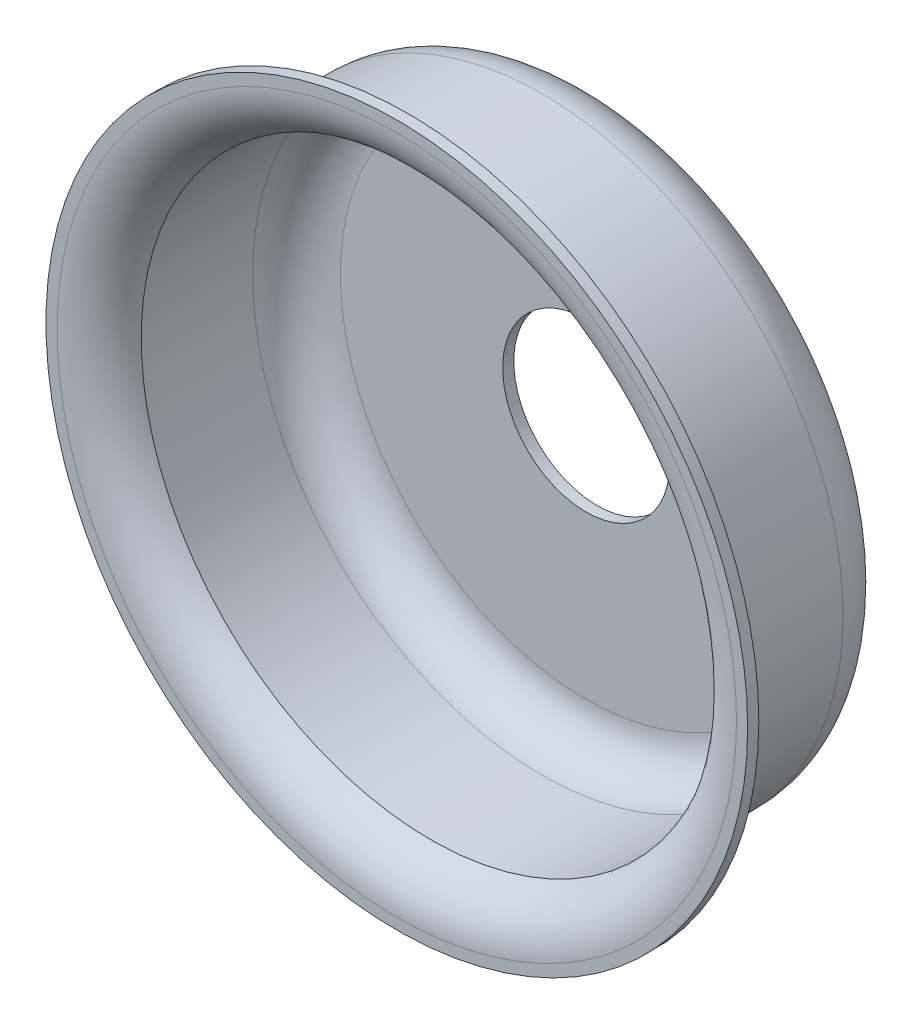
ISO-10303-21;
HEADER;
FILE_DESCRIPTION(('STEP AP214'),'2;1');
FILE_NAME('part.step','',(''),(''),'','','');
FILE_SCHEMA(('AUTOMOTIVE_DESIGN { 1 0 10303 214 1 1 1 1 }'));
ENDSEC;
DATA;
#1=APPLICATION_CONTEXT('core data for automotive mechanical design processes');
#2=APPLICATION_PROTOCOL_DEFINITION('international standard','automotive_design',2000,#1);
#3=PRODUCT_CONTEXT('',#1,'mechanical');
#4=PRODUCT('Part','Part','',(#3));
#5=PRODUCT_RELATED_PRODUCT_CATEGORY('part','',(#4));
#6=PRODUCT_DEFINITION_FORMATION('','',#4);
#7=PRODUCT_DEFINITION_CONTEXT('part definition',#1,'design');
#8=PRODUCT_DEFINITION('design','',#6,#7);
#9=PRODUCT_DEFINITION_SHAPE('','',#8);
#10=(LENGTH_UNIT() NAMED_UNIT(*) SI_UNIT(.MILLI.,.METRE.));
#11=(NAMED_UNIT(*) PLANE_ANGLE_UNIT() SI_UNIT($,.RADIAN.));
#12=(NAMED_UNIT(*) SI_UNIT($,.STERADIAN.) SOLID_ANGLE_UNIT());
#13=UNCERTAINTY_MEASURE_WITH_UNIT(LENGTH_MEASURE(1.E-05),#10,'distance_accuracy_value','');
#14=(GEOMETRIC_REPRESENTATION_CONTEXT(3) GLOBAL_UNCERTAINTY_ASSIGNED_CONTEXT((#13)) GLOBAL_UNIT_ASSIGNED_CONTEXT((#10,
#11,#12)) REPRESENTATION_CONTEXT('',''));
#15=CARTESIAN_POINT('',(0.,0.,0.));
#16=DIRECTION('',(0.,0.,1.));
#17=DIRECTION('',(1.,0.,0.));
#18=AXIS2_PLACEMENT_3D('',#15,#16,#17);
#19=CARTESIAN_POINT('',(0.,0.,11.4444043278498));
#20=DIRECTION('',(0.,0.,1.));
#21=DIRECTION('',(1.,0.,0.));
#22=AXIS2_PLACEMENT_3D('',#19,#20,#21);
#23=CYLINDRICAL_SURFACE('',#22,8.001);
#24=CARTESIAN_POINT('',(0.,0.,0.));
#25=DIRECTION('',(0.,0.,1.));
#26=DIRECTION('',(1.,0.,0.));
#27=AXIS2_PLACEMENT_3D('',#24,#25,#26);
#28=CIRCLE('',#27,8.001);
#29=CARTESIAN_POINT('',(8.001,0.,0.));
#30=VERTEX_POINT('',#29);
#31=EDGE_CURVE('E12',#30,#30,#28,.T.);
#32=ORIENTED_EDGE('',*,*,#31,.F.);
#33=EDGE_LOOP('',(#32));
#34=FACE_BOUND('',#33,.T.);
#35=CARTESIAN_POINT('',(0.,0.,-0.254000000000001));
#36=DIRECTION('',(0.,0.,1.));
#37=DIRECTION('',(1.,0.,0.));
#38=AXIS2_PLACEMENT_3D('',#35,#36,#37);
#39=CIRCLE('',#38,8.001);
#40=CARTESIAN_POINT('',(8.001,0.,-0.254000000000001));
#41=VERTEX_POINT('',#40);
#42=EDGE_CURVE('E86',#41,#41,#39,.T.);
#43=ORIENTED_EDGE('',*,*,#42,.T.);
#44=EDGE_LOOP('',(#43));
#45=FACE_BOUND('',#44,.T.);
#46=ADVANCED_FACE('F46',(#34,#45),#23,.T.);
#47=CARTESIAN_POINT('',(0.,8.001,0.));
#48=DIRECTION('',(0.,0.,-1.));
#49=DIRECTION('',(-1.,0.,0.));
#50=AXIS2_PLACEMENT_3D('',#47,#48,#49);
#51=PLANE('',#50);
#52=CARTESIAN_POINT('',(0.,0.,0.));
#53=DIRECTION('',(0.,0.,1.));
#54=DIRECTION('',(1.,0.,0.));
#55=AXIS2_PLACEMENT_3D('',#52,#53,#54);
#56=CIRCLE('',#55,7.747);
#57=CARTESIAN_POINT('',(7.747,0.,0.));
#58=VERTEX_POINT('',#57);
#59=EDGE_CURVE('E52',#58,#58,#56,.T.);
#60=ORIENTED_EDGE('',*,*,#59,.F.);
#61=EDGE_LOOP('',(#60));
#62=FACE_BOUND('',#61,.T.);
#63=ORIENTED_EDGE('',*,*,#31,.T.);
#64=EDGE_LOOP('',(#63));
#65=FACE_BOUND('',#64,.T.);
#66=ADVANCED_FACE('F147',(#62,#65),#51,.F.);
#67=CARTESIAN_POINT('',(0.,0.,-1.23042428653696));
#68=DIRECTION('',(0.,0.,1.));
#69=DIRECTION('',(1.,0.,0.));
#70=AXIS2_PLACEMENT_3D('',#67,#68,#69);
#71=TOROIDAL_SURFACE('',#70,7.747,1.23042428653696);
#72=CARTESIAN_POINT('',(0.,0.,-0.774908178259771));
#73=DIRECTION('',(0.,0.,1.));
#74=DIRECTION('',(1.,0.,0.));
#75=AXIS2_PLACEMENT_3D('',#72,#73,#74);
#76=CIRCLE('',#75,6.604);
#77=CARTESIAN_POINT('',(6.604,0.,-0.774908178259771));
#78=VERTEX_POINT('',#77);
#79=EDGE_CURVE('E56',#78,#78,#76,.T.);
#80=ORIENTED_EDGE('',*,*,#79,.F.);
#81=EDGE_LOOP('',(#80));
#82=FACE_BOUND('',#81,.T.);
#83=ORIENTED_EDGE('',*,*,#59,.T.);
#84=EDGE_LOOP('',(#83));
#85=FACE_BOUND('',#84,.T.);
#86=ADVANCED_FACE('F142',(#82,#85),#71,.T.);
#87=CARTESIAN_POINT('',(0.,0.,11.4444043278498));
#88=DIRECTION('',(0.,0.,1.));
#89=DIRECTION('',(1.,0.,0.));
#90=AXIS2_PLACEMENT_3D('',#87,#88,#89);
#91=CYLINDRICAL_SURFACE('',#90,6.604);
#92=CARTESIAN_POINT('',(0.,0.,-3.31799945999999));
#93=DIRECTION('',(0.,0.,1.));
#94=DIRECTION('',(1.,0.,0.));
#95=AXIS2_PLACEMENT_3D('',#92,#93,#94);
#96=CIRCLE('',#95,6.604);
#97=CARTESIAN_POINT('',(6.604,0.,-3.31799945999999));
#98=VERTEX_POINT('',#97);
#99=EDGE_CURVE('E60',#98,#98,#96,.T.);
#100=ORIENTED_EDGE('',*,*,#99,.F.);
#101=EDGE_LOOP('',(#100));
#102=FACE_BOUND('',#101,.T.);
#103=ORIENTED_EDGE('',*,*,#79,.T.);
#104=EDGE_LOOP('',(#103));
#105=FACE_BOUND('',#104,.T.);
#106=ADVANCED_FACE('F136',(#102,#105),#91,.F.);
#107=CARTESIAN_POINT('',(0.,0.,-3.31799946));
#108=DIRECTION('',(0.,0.,1.));
#109=DIRECTION('',(1.,0.,0.));
#110=AXIS2_PLACEMENT_3D('',#107,#108,#109);
#111=TOROIDAL_SURFACE('',#110,5.60399946,1.00000054);
#112=CARTESIAN_POINT('',(0.,0.,-4.318));
#113=DIRECTION('',(0.,0.,1.));
#114=DIRECTION('',(1.,0.,0.));
#115=AXIS2_PLACEMENT_3D('',#112,#113,#114);
#116=CIRCLE('',#115,5.60399945999999);
#117=CARTESIAN_POINT('',(5.60399945999999,0.,-4.318));
#118=VERTEX_POINT('',#117);
#119=EDGE_CURVE('E65',#118,#118,#116,.T.);
#120=ORIENTED_EDGE('',*,*,#119,.F.);
#121=EDGE_LOOP('',(#120));
#122=FACE_BOUND('',#121,.T.);
#123=ORIENTED_EDGE('',*,*,#99,.T.);
#124=EDGE_LOOP('',(#123));
#125=FACE_BOUND('',#124,.T.);
#126=ADVANCED_FACE('F130',(#122,#125),#111,.F.);
#127=CARTESIAN_POINT('',(0.,5.60399945999999,-4.318));
#128=DIRECTION('',(0.,0.,-1.));
#129=DIRECTION('',(-1.,0.,0.));
#130=AXIS2_PLACEMENT_3D('',#127,#128,#129);
#131=PLANE('',#130);
#132=CARTESIAN_POINT('',(0.,0.,-4.318));
#133=DIRECTION('',(0.,0.,1.));
#134=DIRECTION('',(1.,0.,0.));
#135=AXIS2_PLACEMENT_3D('',#132,#133,#134);
#136=CIRCLE('',#135,1.905);
#137=CARTESIAN_POINT('',(1.905,0.,-4.318));
#138=VERTEX_POINT('',#137);
#139=EDGE_CURVE('E68',#138,#138,#136,.T.);
#140=ORIENTED_EDGE('',*,*,#139,.F.);
#141=EDGE_LOOP('',(#140));
#142=FACE_BOUND('',#141,.T.);
#143=ORIENTED_EDGE('',*,*,#119,.T.);
#144=EDGE_LOOP('',(#143));
#145=FACE_BOUND('',#144,.T.);
#146=ADVANCED_FACE('F124',(#142,#145),#131,.F.);
#147=CARTESIAN_POINT('',(0.,0.,11.4444043278498));
#148=DIRECTION('',(0.,0.,1.));
#149=DIRECTION('',(1.,0.,0.));
#150=AXIS2_PLACEMENT_3D('',#147,#148,#149);
#151=CYLINDRICAL_SURFACE('',#150,1.905);
#152=CARTESIAN_POINT('',(0.,0.,-4.572));
#153=DIRECTION('',(0.,0.,1.));
#154=DIRECTION('',(1.,0.,0.));
#155=AXIS2_PLACEMENT_3D('',#152,#153,#154);
#156=CIRCLE('',#155,1.905);
#157=CARTESIAN_POINT('',(1.905,0.,-4.572));
#158=VERTEX_POINT('',#157);
#159=EDGE_CURVE('E71',#158,#158,#156,.T.);
#160=ORIENTED_EDGE('',*,*,#159,.F.);
#161=EDGE_LOOP('',(#160));
#162=FACE_BOUND('',#161,.T.);
#163=ORIENTED_EDGE('',*,*,#139,.T.);
#164=EDGE_LOOP('',(#163));
#165=FACE_BOUND('',#164,.T.);
#166=ADVANCED_FACE('F118',(#162,#165),#151,.F.);
#167=CARTESIAN_POINT('',(0.,5.60399945999999,-4.572));
#168=DIRECTION('',(0.,0.,1.));
#169=DIRECTION('',(1.,0.,0.));
#170=AXIS2_PLACEMENT_3D('',#167,#168,#169);
#171=PLANE('',#170);
#172=CARTESIAN_POINT('',(0.,0.,-4.572));
#173=DIRECTION('',(0.,0.,1.));
#174=DIRECTION('',(1.,0.,0.));
#175=AXIS2_PLACEMENT_3D('',#172,#173,#174);
#176=CIRCLE('',#175,5.60399945999999);
#177=CARTESIAN_POINT('',(5.60399945999999,0.,-4.572));
#178=VERTEX_POINT('',#177);
#179=EDGE_CURVE('E74',#178,#178,#176,.T.);
#180=ORIENTED_EDGE('',*,*,#179,.F.);
#181=EDGE_LOOP('',(#180));
#182=FACE_BOUND('',#181,.T.);
#183=ORIENTED_EDGE('',*,*,#159,.T.);
#184=EDGE_LOOP('',(#183));
#185=FACE_BOUND('',#184,.T.);
#186=ADVANCED_FACE('F112',(#182,#185),#171,.F.);
#187=CARTESIAN_POINT('',(0.,0.,-3.31799945999999));
#188=DIRECTION('',(0.,0.,1.));
#189=DIRECTION('',(1.,0.,0.));
#190=AXIS2_PLACEMENT_3D('',#187,#188,#189);
#191=TOROIDAL_SURFACE('',#190,5.60399945999999,1.25400054);
#192=CARTESIAN_POINT('',(0.,0.,-3.31799945999999));
#193=DIRECTION('',(0.,0.,1.));
#194=DIRECTION('',(1.,0.,0.));
#195=AXIS2_PLACEMENT_3D('',#192,#193,#194);
#196=CIRCLE('',#195,6.858);
#197=CARTESIAN_POINT('',(6.858,0.,-3.31799945999999));
#198=VERTEX_POINT('',#197);
#199=EDGE_CURVE('E77',#198,#198,#196,.T.);
#200=ORIENTED_EDGE('',*,*,#199,.F.);
#201=EDGE_LOOP('',(#200));
#202=FACE_BOUND('',#201,.T.);
#203=ORIENTED_EDGE('',*,*,#179,.T.);
#204=EDGE_LOOP('',(#203));
#205=FACE_BOUND('',#204,.T.);
#206=ADVANCED_FACE('F106',(#202,#205),#191,.T.);
#207=CARTESIAN_POINT('',(0.,0.,11.4444043278498));
#208=DIRECTION('',(0.,0.,1.));
#209=DIRECTION('',(1.,0.,0.));
#210=AXIS2_PLACEMENT_3D('',#207,#208,#209);
#211=CYLINDRICAL_SURFACE('',#210,6.858);
#212=CARTESIAN_POINT('',(0.,0.,-0.774908178259771));
#213=DIRECTION('',(0.,0.,1.));
#214=DIRECTION('',(1.,0.,0.));
#215=AXIS2_PLACEMENT_3D('',#212,#213,#214);
#216=CIRCLE('',#215,6.858);
#217=CARTESIAN_POINT('',(6.858,0.,-0.774908178259771));
#218=VERTEX_POINT('',#217);
#219=EDGE_CURVE('E80',#218,#218,#216,.T.);
#220=ORIENTED_EDGE('',*,*,#219,.F.);
#221=EDGE_LOOP('',(#220));
#222=FACE_BOUND('',#221,.T.);
#223=ORIENTED_EDGE('',*,*,#199,.T.);
#224=EDGE_LOOP('',(#223));
#225=FACE_BOUND('',#224,.T.);
#226=ADVANCED_FACE('F100',(#222,#225),#211,.T.);
#227=CARTESIAN_POINT('',(0.,0.,-1.27305323671888));
#228=DIRECTION('',(0.,0.,1.));
#229=DIRECTION('',(1.,0.,0.));
#230=AXIS2_PLACEMENT_3D('',#227,#228,#229);
#231=TOROIDAL_SURFACE('',#230,7.747,1.01905323671888);
#232=CARTESIAN_POINT('',(0.,0.,-0.253999999999999));
#233=DIRECTION('',(0.,0.,1.));
#234=DIRECTION('',(1.,0.,0.));
#235=AXIS2_PLACEMENT_3D('',#232,#233,#234);
#236=CIRCLE('',#235,7.747);
#237=CARTESIAN_POINT('',(7.747,0.,-0.253999999999999));
#238=VERTEX_POINT('',#237);
#239=EDGE_CURVE('E83',#238,#238,#236,.T.);
#240=ORIENTED_EDGE('',*,*,#239,.F.);
#241=EDGE_LOOP('',(#240));
#242=FACE_BOUND('',#241,.T.);
#243=ORIENTED_EDGE('',*,*,#219,.T.);
#244=EDGE_LOOP('',(#243));
#245=FACE_BOUND('',#244,.T.);
#246=ADVANCED_FACE('F94',(#242,#245),#231,.F.);
#247=CARTESIAN_POINT('',(0.,8.001,-0.254));
#248=DIRECTION('',(0.,0.,1.));
#249=DIRECTION('',(1.,0.,0.));
#250=AXIS2_PLACEMENT_3D('',#247,#248,#249);
#251=PLANE('',#250);
#252=ORIENTED_EDGE('',*,*,#42,.F.);
#253=EDGE_LOOP('',(#252));
#254=FACE_BOUND('',#253,.T.);
#255=ORIENTED_EDGE('',*,*,#239,.T.);
#256=EDGE_LOOP('',(#255));
#257=FACE_BOUND('',#256,.T.);
#258=ADVANCED_FACE('F91',(#254,#257),#251,.F.);
#259=CLOSED_SHELL('',(#46,#66,#86,#106,#126,#146,#166,#186,#206,#226,#246,#258));
#260=MANIFOLD_SOLID_BREP('B2',#259);
#261=ADVANCED_BREP_SHAPE_REPRESENTATION('',(#18,#260),#14);
#262=SHAPE_DEFINITION_REPRESENTATION(#9,#261);
ENDSEC;
END-ISO-10303-21;
